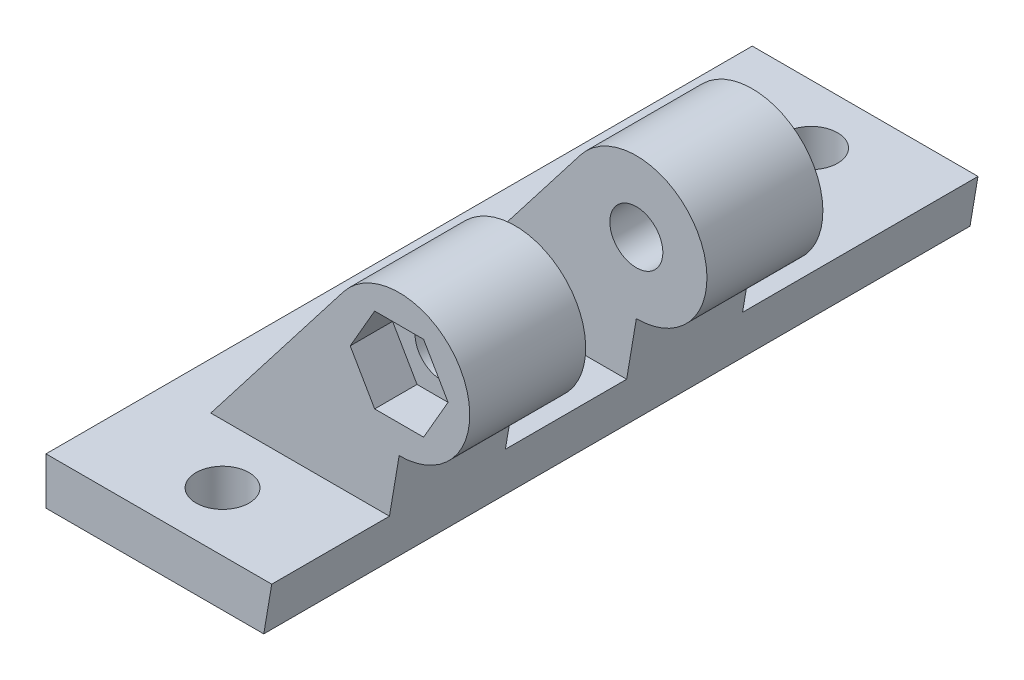
ISO-10303-21;
HEADER;
FILE_DESCRIPTION(('STEP AP214'),'2;1');
FILE_NAME('part.step','',(''),(''),'','','');
FILE_SCHEMA(('AUTOMOTIVE_DESIGN { 1 0 10303 214 1 1 1 1 }'));
ENDSEC;
DATA;
#1=APPLICATION_CONTEXT('core data for automotive mechanical design processes');
#2=APPLICATION_PROTOCOL_DEFINITION('international standard','automotive_design',2000,#1);
#3=PRODUCT_CONTEXT('',#1,'mechanical');
#4=PRODUCT('Part','Part','',(#3));
#5=PRODUCT_RELATED_PRODUCT_CATEGORY('part','',(#4));
#6=PRODUCT_DEFINITION_FORMATION('','',#4);
#7=PRODUCT_DEFINITION_CONTEXT('part definition',#1,'design');
#8=PRODUCT_DEFINITION('design','',#6,#7);
#9=PRODUCT_DEFINITION_SHAPE('','',#8);
#10=(LENGTH_UNIT() NAMED_UNIT(*) SI_UNIT(.MILLI.,.METRE.));
#11=(NAMED_UNIT(*) PLANE_ANGLE_UNIT() SI_UNIT($,.RADIAN.));
#12=(NAMED_UNIT(*) SI_UNIT($,.STERADIAN.) SOLID_ANGLE_UNIT());
#13=UNCERTAINTY_MEASURE_WITH_UNIT(LENGTH_MEASURE(1.E-05),#10,'distance_accuracy_value','');
#14=(GEOMETRIC_REPRESENTATION_CONTEXT(3) GLOBAL_UNCERTAINTY_ASSIGNED_CONTEXT((#13)) GLOBAL_UNIT_ASSIGNED_CONTEXT((#10,
#11,#12)) REPRESENTATION_CONTEXT('',''));
#15=CARTESIAN_POINT('',(0.,0.,0.));
#16=DIRECTION('',(0.,0.,1.));
#17=DIRECTION('',(1.,0.,0.));
#18=AXIS2_PLACEMENT_3D('',#15,#16,#17);
#19=CARTESIAN_POINT('',(10.,15.8653034599232,10.15));
#20=DIRECTION('',(0.,0.,1.));
#21=DIRECTION('',(1.,0.,0.));
#22=AXIS2_PLACEMENT_3D('',#19,#20,#21);
#23=CYLINDRICAL_SURFACE('',#22,2.25);
#24=CARTESIAN_POINT('',(10.,15.8653034599232,10.15));
#25=DIRECTION('',(0.,0.,1.));
#26=DIRECTION('',(1.,0.,0.));
#27=AXIS2_PLACEMENT_3D('',#24,#25,#26);
#28=CIRCLE('',#27,2.25);
#29=CARTESIAN_POINT('',(12.25,15.8653034599232,10.15));
#30=VERTEX_POINT('',#29);
#31=EDGE_CURVE('E317',#30,#30,#28,.T.);
#32=ORIENTED_EDGE('',*,*,#31,.F.);
#33=EDGE_LOOP('',(#32));
#34=FACE_BOUND('',#33,.T.);
#35=CARTESIAN_POINT('',(10.,15.8653034599232,16.4));
#36=DIRECTION('',(0.,0.,1.));
#37=DIRECTION('',(1.,0.,0.));
#38=AXIS2_PLACEMENT_3D('',#35,#36,#37);
#39=CIRCLE('',#38,2.25);
#40=CARTESIAN_POINT('',(12.25,15.8653034599232,16.4));
#41=VERTEX_POINT('',#40);
#42=EDGE_CURVE('E43',#41,#41,#39,.F.);
#43=ORIENTED_EDGE('',*,*,#42,.F.);
#44=EDGE_LOOP('',(#43));
#45=FACE_BOUND('',#44,.T.);
#46=ADVANCED_FACE('F39',(#34,#45),#23,.F.);
#47=CARTESIAN_POINT('',(-10.,5.,-30.));
#48=DIRECTION('',(0.,0.,1.));
#49=DIRECTION('',(1.,0.,0.));
#50=AXIS2_PLACEMENT_3D('',#47,#48,#49);
#51=PLANE('',#50);
#52=DIRECTION('',(-1.,0.,0.));
#53=VECTOR('',#52,1.);
#54=CARTESIAN_POINT('',(-10.,5.,-30.));
#55=LINE('',#54,#53);
#56=CARTESIAN_POINT('',(9.17679578337323,5.,-30.));
#57=VERTEX_POINT('',#56);
#58=CARTESIAN_POINT('',(-10.,5.,-30.));
#59=VERTEX_POINT('',#58);
#60=EDGE_CURVE('E369',#57,#59,#55,.T.);
#61=ORIENTED_EDGE('',*,*,#60,.F.);
#62=DIRECTION('',(0.166827799797444,0.985986047170417,0.));
#63=VECTOR('',#62,1.);
#64=CARTESIAN_POINT('',(8.5,1.,-30.));
#65=LINE('',#64,#63);
#66=CARTESIAN_POINT('',(8.5,1.,-30.));
#67=VERTEX_POINT('',#66);
#68=EDGE_CURVE('E243',#67,#57,#65,.T.);
#69=ORIENTED_EDGE('',*,*,#68,.F.);
#70=DIRECTION('',(1.,0.,0.));
#71=VECTOR('',#70,1.);
#72=CARTESIAN_POINT('',(-10.,1.,-30.));
#73=LINE('',#72,#71);
#74=CARTESIAN_POINT('',(-10.,1.,-30.));
#75=VERTEX_POINT('',#74);
#76=EDGE_CURVE('E279',#75,#67,#73,.T.);
#77=ORIENTED_EDGE('',*,*,#76,.F.);
#78=DIRECTION('',(0.,-1.,0.));
#79=VECTOR('',#78,1.);
#80=CARTESIAN_POINT('',(-10.,5.,-30.));
#81=LINE('',#80,#79);
#82=EDGE_CURVE('E11',#59,#75,#81,.T.);
#83=ORIENTED_EDGE('',*,*,#82,.F.);
#84=EDGE_LOOP('',(#61,#69,#77,#83));
#85=FACE_BOUND('',#84,.T.);
#86=ADVANCED_FACE('F41',(#85),#51,.F.);
#87=CARTESIAN_POINT('',(-10.,5.,30.));
#88=DIRECTION('',(1.,0.,0.));
#89=DIRECTION('',(0.,0.,-1.));
#90=AXIS2_PLACEMENT_3D('',#87,#88,#89);
#91=PLANE('',#90);
#92=DIRECTION('',(0.,0.,-1.));
#93=VECTOR('',#92,1.);
#94=CARTESIAN_POINT('',(-10.,1.,30.));
#95=LINE('',#94,#93);
#96=CARTESIAN_POINT('',(-10.,1.,30.));
#97=VERTEX_POINT('',#96);
#98=EDGE_CURVE('E276',#97,#75,#95,.T.);
#99=ORIENTED_EDGE('',*,*,#98,.F.);
#100=DIRECTION('',(0.,-1.,0.));
#101=VECTOR('',#100,1.);
#102=CARTESIAN_POINT('',(-10.,5.,30.));
#103=LINE('',#102,#101);
#104=CARTESIAN_POINT('',(-10.,5.,30.));
#105=VERTEX_POINT('',#104);
#106=EDGE_CURVE('E49',#105,#97,#103,.T.);
#107=ORIENTED_EDGE('',*,*,#106,.F.);
#108=DIRECTION('',(0.,0.,1.));
#109=VECTOR('',#108,1.);
#110=CARTESIAN_POINT('',(-10.,5.,30.));
#111=LINE('',#110,#109);
#112=EDGE_CURVE('E372',#59,#105,#111,.T.);
#113=ORIENTED_EDGE('',*,*,#112,.F.);
#114=ORIENTED_EDGE('',*,*,#82,.T.);
#115=EDGE_LOOP('',(#99,#107,#113,#114));
#116=FACE_BOUND('',#115,.T.);
#117=ADVANCED_FACE('F429',(#116),#91,.F.);
#118=CARTESIAN_POINT('',(-10.,5.,30.));
#119=DIRECTION('',(0.,0.,-1.));
#120=DIRECTION('',(-1.,0.,0.));
#121=AXIS2_PLACEMENT_3D('',#118,#119,#120);
#122=PLANE('',#121);
#123=DIRECTION('',(-1.,0.,0.));
#124=VECTOR('',#123,1.);
#125=CARTESIAN_POINT('',(-10.,1.,30.));
#126=LINE('',#125,#124);
#127=CARTESIAN_POINT('',(8.49999999999998,1.,30.));
#128=VERTEX_POINT('',#127);
#129=EDGE_CURVE('E272',#128,#97,#126,.T.);
#130=ORIENTED_EDGE('',*,*,#129,.F.);
#131=DIRECTION('',(0.166827799797444,0.985986047170417,0.));
#132=VECTOR('',#131,1.);
#133=CARTESIAN_POINT('',(8.49999999999998,1.,30.));
#134=LINE('',#133,#132);
#135=CARTESIAN_POINT('',(9.17679578337321,5.,30.));
#136=VERTEX_POINT('',#135);
#137=EDGE_CURVE('E65',#128,#136,#134,.T.);
#138=ORIENTED_EDGE('',*,*,#137,.T.);
#139=DIRECTION('',(1.,0.,0.));
#140=VECTOR('',#139,1.);
#141=CARTESIAN_POINT('',(-10.,5.,30.));
#142=LINE('',#141,#140);
#143=EDGE_CURVE('E375',#105,#136,#142,.T.);
#144=ORIENTED_EDGE('',*,*,#143,.F.);
#145=ORIENTED_EDGE('',*,*,#106,.T.);
#146=EDGE_LOOP('',(#130,#138,#144,#145));
#147=FACE_BOUND('',#146,.T.);
#148=ADVANCED_FACE('F452',(#147),#122,.F.);
#149=CARTESIAN_POINT('',(0.,5.,-25.));
#150=DIRECTION('',(0.,-1.,0.));
#151=DIRECTION('',(0.,0.,-1.));
#152=AXIS2_PLACEMENT_3D('',#149,#150,#151);
#153=CYLINDRICAL_SURFACE('',#152,2.25);
#154=CARTESIAN_POINT('',(0.,5.,-25.));
#155=DIRECTION('',(0.,1.,0.));
#156=DIRECTION('',(0.,0.,1.));
#157=AXIS2_PLACEMENT_3D('',#154,#155,#156);
#158=CIRCLE('',#157,2.25);
#159=CARTESIAN_POINT('',(0.,5.,-22.75));
#160=VERTEX_POINT('',#159);
#161=EDGE_CURVE('E365',#160,#160,#158,.T.);
#162=ORIENTED_EDGE('',*,*,#161,.T.);
#163=EDGE_LOOP('',(#162));
#164=FACE_BOUND('',#163,.T.);
#165=CARTESIAN_POINT('',(0.,1.,-25.));
#166=DIRECTION('',(0.,-1.,0.));
#167=DIRECTION('',(0.,0.,-1.));
#168=AXIS2_PLACEMENT_3D('',#165,#166,#167);
#169=CIRCLE('',#168,2.25);
#170=CARTESIAN_POINT('',(0.,1.,-27.25));
#171=VERTEX_POINT('',#170);
#172=EDGE_CURVE('E268',#171,#171,#169,.T.);
#173=ORIENTED_EDGE('',*,*,#172,.T.);
#174=EDGE_LOOP('',(#173));
#175=FACE_BOUND('',#174,.T.);
#176=ADVANCED_FACE('F448',(#164,#175),#153,.F.);
#177=CARTESIAN_POINT('',(0.,5.,25.));
#178=DIRECTION('',(0.,-1.,0.));
#179=DIRECTION('',(0.,0.,-1.));
#180=AXIS2_PLACEMENT_3D('',#177,#178,#179);
#181=CYLINDRICAL_SURFACE('',#180,2.25);
#182=CARTESIAN_POINT('',(0.,5.,25.));
#183=DIRECTION('',(0.,1.,0.));
#184=DIRECTION('',(0.,0.,1.));
#185=AXIS2_PLACEMENT_3D('',#182,#183,#184);
#186=CIRCLE('',#185,2.25);
#187=CARTESIAN_POINT('',(0.,5.,27.25));
#188=VERTEX_POINT('',#187);
#189=EDGE_CURVE('E356',#188,#188,#186,.T.);
#190=ORIENTED_EDGE('',*,*,#189,.T.);
#191=EDGE_LOOP('',(#190));
#192=FACE_BOUND('',#191,.T.);
#193=CARTESIAN_POINT('',(0.,1.,25.));
#194=DIRECTION('',(0.,-1.,0.));
#195=DIRECTION('',(0.,0.,-1.));
#196=AXIS2_PLACEMENT_3D('',#193,#194,#195);
#197=CIRCLE('',#196,2.25);
#198=CARTESIAN_POINT('',(0.,1.,22.75));
#199=VERTEX_POINT('',#198);
#200=EDGE_CURVE('E273',#199,#199,#197,.T.);
#201=ORIENTED_EDGE('',*,*,#200,.T.);
#202=EDGE_LOOP('',(#201));
#203=FACE_BOUND('',#202,.T.);
#204=ADVANCED_FACE('F445',(#192,#203),#181,.F.);
#205=CARTESIAN_POINT('',(0.,5.,0.));
#206=DIRECTION('',(0.,-1.,0.));
#207=DIRECTION('',(0.,0.,-1.));
#208=AXIS2_PLACEMENT_3D('',#205,#206,#207);
#209=PLANE('',#208);
#210=ORIENTED_EDGE('',*,*,#161,.F.);
#211=EDGE_LOOP('',(#210));
#212=FACE_BOUND('',#211,.T.);
#213=ORIENTED_EDGE('',*,*,#189,.F.);
#214=EDGE_LOOP('',(#213));
#215=FACE_BOUND('',#214,.T.);
#216=ORIENTED_EDGE('',*,*,#143,.T.);
#217=DIRECTION('',(0.,0.,-1.));
#218=VECTOR('',#217,1.);
#219=CARTESIAN_POINT('',(9.17679578337322,5.,0.));
#220=LINE('',#219,#218);
#221=CARTESIAN_POINT('',(9.17679578337321,5.,20.));
#222=VERTEX_POINT('',#221);
#223=EDGE_CURVE('E256',#136,#222,#220,.T.);
#224=ORIENTED_EDGE('',*,*,#223,.T.);
#225=DIRECTION('',(1.,0.,0.));
#226=VECTOR('',#225,1.);
#227=CARTESIAN_POINT('',(10.,5.,20.));
#228=LINE('',#227,#226);
#229=CARTESIAN_POINT('',(-5.99999999999998,5.,20.));
#230=VERTEX_POINT('',#229);
#231=EDGE_CURVE('E334',#230,#222,#228,.T.);
#232=ORIENTED_EDGE('',*,*,#231,.F.);
#233=DIRECTION('',(0.,0.,1.));
#234=VECTOR('',#233,1.);
#235=CARTESIAN_POINT('',(-5.99999999999998,5.,10.15));
#236=LINE('',#235,#234);
#237=CARTESIAN_POINT('',(-5.99999999999998,5.,10.15));
#238=VERTEX_POINT('',#237);
#239=EDGE_CURVE('E357',#238,#230,#236,.T.);
#240=ORIENTED_EDGE('',*,*,#239,.F.);
#241=DIRECTION('',(1.,0.,0.));
#242=VECTOR('',#241,1.);
#243=CARTESIAN_POINT('',(10.,5.,10.15));
#244=LINE('',#243,#242);
#245=CARTESIAN_POINT('',(9.17679578337322,5.,10.15));
#246=VERTEX_POINT('',#245);
#247=EDGE_CURVE('E338',#238,#246,#244,.T.);
#248=ORIENTED_EDGE('',*,*,#247,.T.);
#249=CARTESIAN_POINT('',(9.17679578337322,5.,-0.149999999999996));
#250=VERTEX_POINT('',#249);
#251=EDGE_CURVE('E257',#246,#250,#220,.T.);
#252=ORIENTED_EDGE('',*,*,#251,.T.);
#253=DIRECTION('',(-1.,0.,0.));
#254=VECTOR('',#253,1.);
#255=CARTESIAN_POINT('',(10.,5.,-0.149999999999996));
#256=LINE('',#255,#254);
#257=CARTESIAN_POINT('',(-5.99999999999998,5.,-0.149999999999996));
#258=VERTEX_POINT('',#257);
#259=EDGE_CURVE('E296',#250,#258,#256,.T.);
#260=ORIENTED_EDGE('',*,*,#259,.T.);
#261=DIRECTION('',(0.,0.,-1.));
#262=VECTOR('',#261,1.);
#263=CARTESIAN_POINT('',(-5.99999999999998,5.,-0.149999999999996));
#264=LINE('',#263,#262);
#265=CARTESIAN_POINT('',(-5.99999999999998,5.,-9.99999999999999));
#266=VERTEX_POINT('',#265);
#267=EDGE_CURVE('E318',#258,#266,#264,.T.);
#268=ORIENTED_EDGE('',*,*,#267,.T.);
#269=DIRECTION('',(-1.,0.,0.));
#270=VECTOR('',#269,1.);
#271=CARTESIAN_POINT('',(10.,5.,-9.99999999999999));
#272=LINE('',#271,#270);
#273=CARTESIAN_POINT('',(9.17679578337322,5.,-9.99999999999999));
#274=VERTEX_POINT('',#273);
#275=EDGE_CURVE('E308',#274,#266,#272,.T.);
#276=ORIENTED_EDGE('',*,*,#275,.F.);
#277=EDGE_CURVE('E251',#274,#57,#220,.T.);
#278=ORIENTED_EDGE('',*,*,#277,.T.);
#279=ORIENTED_EDGE('',*,*,#60,.T.);
#280=ORIENTED_EDGE('',*,*,#112,.T.);
#281=EDGE_LOOP('',(#216,#224,#232,#240,#248,#252,#260,#268,#276,#278,#279,#280));
#282=FACE_BOUND('',#281,.T.);
#283=ADVANCED_FACE('F392',(#212,#215,#282),#209,.F.);
#284=CARTESIAN_POINT('',(10.,15.8653034599232,10.15));
#285=DIRECTION('',(0.,0.,1.));
#286=DIRECTION('',(1.,0.,0.));
#287=AXIS2_PLACEMENT_3D('',#284,#285,#286);
#288=CYLINDRICAL_SURFACE('',#287,6.);
#289=CARTESIAN_POINT('',(10.,15.8653034599232,20.));
#290=DIRECTION('',(0.,0.,1.));
#291=DIRECTION('',(1.,0.,0.));
#292=AXIS2_PLACEMENT_3D('',#289,#290,#291);
#293=CIRCLE('',#292,6.);
#294=CARTESIAN_POINT('',(10.,9.86530345992323,20.));
#295=VERTEX_POINT('',#294);
#296=CARTESIAN_POINT('',(5.25568408624558,19.5383766296949,20.));
#297=VERTEX_POINT('',#296);
#298=EDGE_CURVE('E328',#295,#297,#293,.T.);
#299=ORIENTED_EDGE('',*,*,#298,.F.);
#300=DIRECTION('',(0.,0.,1.));
#301=VECTOR('',#300,1.);
#302=CARTESIAN_POINT('',(10.,9.86530345992323,10.15));
#303=LINE('',#302,#301);
#304=CARTESIAN_POINT('',(10.,9.86530345992323,10.15));
#305=VERTEX_POINT('',#304);
#306=EDGE_CURVE('E353',#305,#295,#303,.T.);
#307=ORIENTED_EDGE('',*,*,#306,.F.);
#308=CARTESIAN_POINT('',(10.,15.8653034599232,10.15));
#309=DIRECTION('',(0.,0.,1.));
#310=DIRECTION('',(1.,0.,0.));
#311=AXIS2_PLACEMENT_3D('',#308,#309,#310);
#312=CIRCLE('',#311,6.);
#313=CARTESIAN_POINT('',(5.25568408624558,19.5383766296949,10.15));
#314=VERTEX_POINT('',#313);
#315=EDGE_CURVE('E329',#305,#314,#312,.T.);
#316=ORIENTED_EDGE('',*,*,#315,.T.);
#317=DIRECTION('',(0.,0.,1.));
#318=VECTOR('',#317,1.);
#319=CARTESIAN_POINT('',(5.25568408624558,19.5383766296949,10.15));
#320=LINE('',#319,#318);
#321=EDGE_CURVE('E342',#314,#297,#320,.T.);
#322=ORIENTED_EDGE('',*,*,#321,.T.);
#323=EDGE_LOOP('',(#299,#307,#316,#322));
#324=FACE_BOUND('',#323,.T.);
#325=ADVANCED_FACE('F440',(#324),#288,.T.);
#326=CARTESIAN_POINT('',(-5.99999999999998,5.,10.15));
#327=DIRECTION('',(-0.790719318959074,0.612178861628608,0.));
#328=DIRECTION('',(-0.612178861628608,-0.790719318959074,0.));
#329=AXIS2_PLACEMENT_3D('',#326,#327,#328);
#330=PLANE('',#329);
#331=DIRECTION('',(-0.612178861628608,-0.790719318959074,0.));
#332=VECTOR('',#331,1.);
#333=CARTESIAN_POINT('',(-5.99999999999998,5.,20.));
#334=LINE('',#333,#332);
#335=EDGE_CURVE('E346',#297,#230,#334,.T.);
#336=ORIENTED_EDGE('',*,*,#335,.F.);
#337=ORIENTED_EDGE('',*,*,#321,.F.);
#338=DIRECTION('',(-0.612178861628608,-0.790719318959074,0.));
#339=VECTOR('',#338,1.);
#340=CARTESIAN_POINT('',(-5.99999999999998,5.,10.15));
#341=LINE('',#340,#339);
#342=EDGE_CURVE('E333',#314,#238,#341,.T.);
#343=ORIENTED_EDGE('',*,*,#342,.T.);
#344=ORIENTED_EDGE('',*,*,#239,.T.);
#345=EDGE_LOOP('',(#336,#337,#343,#344));
#346=FACE_BOUND('',#345,.T.);
#347=ADVANCED_FACE('F435',(#346),#330,.T.);
#348=CARTESIAN_POINT('',(10.,15.8653034599232,10.15));
#349=DIRECTION('',(0.,0.,1.));
#350=DIRECTION('',(1.,0.,0.));
#351=AXIS2_PLACEMENT_3D('',#348,#349,#350);
#352=PLANE('',#351);
#353=ORIENTED_EDGE('',*,*,#31,.T.);
#354=EDGE_LOOP('',(#353));
#355=FACE_BOUND('',#354,.T.);
#356=ORIENTED_EDGE('',*,*,#315,.F.);
#357=DIRECTION('',(-0.166827799797444,-0.985986047170417,0.));
#358=VECTOR('',#357,1.);
#359=CARTESIAN_POINT('',(10.9869392972825,15.6983143712117,10.15));
#360=LINE('',#359,#358);
#361=EDGE_CURVE('E261',#305,#246,#360,.T.);
#362=ORIENTED_EDGE('',*,*,#361,.T.);
#363=ORIENTED_EDGE('',*,*,#247,.F.);
#364=ORIENTED_EDGE('',*,*,#342,.F.);
#365=EDGE_LOOP('',(#356,#362,#363,#364));
#366=FACE_BOUND('',#365,.T.);
#367=ADVANCED_FACE('F420',(#355,#366),#352,.F.);
#368=CARTESIAN_POINT('',(10.,15.8653034599232,20.));
#369=DIRECTION('',(0.,0.,1.));
#370=DIRECTION('',(1.,0.,0.));
#371=AXIS2_PLACEMENT_3D('',#368,#369,#370);
#372=PLANE('',#371);
#373=DIRECTION('',(1.,0.,0.));
#374=VECTOR('',#373,1.);
#375=CARTESIAN_POINT('',(7.92153903091737,12.2653034599232,20.));
#376=LINE('',#375,#374);
#377=CARTESIAN_POINT('',(7.92153903091737,12.2653034599232,20.));
#378=VERTEX_POINT('',#377);
#379=CARTESIAN_POINT('',(12.0784609690827,12.2653034599232,20.));
#380=VERTEX_POINT('',#379);
#381=EDGE_CURVE('E57',#378,#380,#376,.T.);
#382=ORIENTED_EDGE('',*,*,#381,.F.);
#383=DIRECTION('',(0.5,-0.866025403784439,0.));
#384=VECTOR('',#383,1.);
#385=CARTESIAN_POINT('',(5.84307806183472,15.8653034599232,20.));
#386=LINE('',#385,#384);
#387=CARTESIAN_POINT('',(5.84307806183472,15.8653034599232,20.));
#388=VERTEX_POINT('',#387);
#389=EDGE_CURVE('E192',#388,#378,#386,.T.);
#390=ORIENTED_EDGE('',*,*,#389,.F.);
#391=DIRECTION('',(-0.5,-0.866025403784439,0.));
#392=VECTOR('',#391,1.);
#393=CARTESIAN_POINT('',(7.92153903091737,19.4653034599232,20.));
#394=LINE('',#393,#392);
#395=CARTESIAN_POINT('',(7.92153903091737,19.4653034599232,20.));
#396=VERTEX_POINT('',#395);
#397=EDGE_CURVE('E196',#396,#388,#394,.T.);
#398=ORIENTED_EDGE('',*,*,#397,.F.);
#399=DIRECTION('',(-1.,0.,0.));
#400=VECTOR('',#399,1.);
#401=CARTESIAN_POINT('',(12.0784609690827,19.4653034599232,20.));
#402=LINE('',#401,#400);
#403=CARTESIAN_POINT('',(12.0784609690827,19.4653034599232,20.));
#404=VERTEX_POINT('',#403);
#405=EDGE_CURVE('E219',#404,#396,#402,.T.);
#406=ORIENTED_EDGE('',*,*,#405,.F.);
#407=DIRECTION('',(-0.5,0.866025403784439,0.));
#408=VECTOR('',#407,1.);
#409=CARTESIAN_POINT('',(14.1569219381653,15.8653034599232,20.));
#410=LINE('',#409,#408);
#411=CARTESIAN_POINT('',(14.1569219381653,15.8653034599232,20.));
#412=VERTEX_POINT('',#411);
#413=EDGE_CURVE('E215',#412,#404,#410,.T.);
#414=ORIENTED_EDGE('',*,*,#413,.F.);
#415=DIRECTION('',(0.5,0.866025403784439,0.));
#416=VECTOR('',#415,1.);
#417=CARTESIAN_POINT('',(12.0784609690827,12.2653034599232,20.));
#418=LINE('',#417,#416);
#419=EDGE_CURVE('E212',#380,#412,#418,.T.);
#420=ORIENTED_EDGE('',*,*,#419,.F.);
#421=EDGE_LOOP('',(#382,#390,#398,#406,#414,#420));
#422=FACE_BOUND('',#421,.T.);
#423=DIRECTION('',(-0.166827799797444,-0.985986047170417,0.));
#424=VECTOR('',#423,1.);
#425=CARTESIAN_POINT('',(10.9869392972825,15.6983143712117,20.));
#426=LINE('',#425,#424);
#427=EDGE_CURVE('E265',#295,#222,#426,.T.);
#428=ORIENTED_EDGE('',*,*,#427,.F.);
#429=ORIENTED_EDGE('',*,*,#298,.T.);
#430=ORIENTED_EDGE('',*,*,#335,.T.);
#431=ORIENTED_EDGE('',*,*,#231,.T.);
#432=EDGE_LOOP('',(#428,#429,#430,#431));
#433=FACE_BOUND('',#432,.T.);
#434=ADVANCED_FACE('F413',(#422,#433),#372,.T.);
#435=CARTESIAN_POINT('',(10.,15.8653034599232,-0.149999999999996));
#436=DIRECTION('',(0.,0.,-1.));
#437=DIRECTION('',(-1.,0.,0.));
#438=AXIS2_PLACEMENT_3D('',#435,#436,#437);
#439=CYLINDRICAL_SURFACE('',#438,6.00000000000001);
#440=CARTESIAN_POINT('',(10.,15.8653034599232,-9.99999999999999));
#441=DIRECTION('',(0.,0.,-1.));
#442=DIRECTION('',(-1.,0.,0.));
#443=AXIS2_PLACEMENT_3D('',#440,#441,#442);
#444=CIRCLE('',#443,6.00000000000001);
#445=CARTESIAN_POINT('',(5.29341514188912,19.5866014825762,-9.99999999999999));
#446=VERTEX_POINT('',#445);
#447=CARTESIAN_POINT('',(10.,9.86530345992323,-9.99999999999998));
#448=VERTEX_POINT('',#447);
#449=EDGE_CURVE('E288',#446,#448,#444,.T.);
#450=ORIENTED_EDGE('',*,*,#449,.F.);
#451=DIRECTION('',(0.,0.,-1.));
#452=VECTOR('',#451,1.);
#453=CARTESIAN_POINT('',(5.29341514188912,19.5866014825762,-0.149999999999996));
#454=LINE('',#453,#452);
#455=CARTESIAN_POINT('',(5.29341514188912,19.5866014825762,-0.149999999999996));
#456=VERTEX_POINT('',#455);
#457=EDGE_CURVE('E314',#456,#446,#454,.T.);
#458=ORIENTED_EDGE('',*,*,#457,.F.);
#459=CARTESIAN_POINT('',(10.,15.8653034599232,-0.149999999999996));
#460=DIRECTION('',(0.,0.,-1.));
#461=DIRECTION('',(-1.,0.,0.));
#462=AXIS2_PLACEMENT_3D('',#459,#460,#461);
#463=CIRCLE('',#462,6.00000000000001);
#464=CARTESIAN_POINT('',(10.,9.86530345992323,-0.14999999999999));
#465=VERTEX_POINT('',#464);
#466=EDGE_CURVE('E292',#456,#465,#463,.T.);
#467=ORIENTED_EDGE('',*,*,#466,.T.);
#468=DIRECTION('',(0.,0.,-1.));
#469=VECTOR('',#468,1.);
#470=CARTESIAN_POINT('',(10.,9.86530345992323,-0.149999999999996));
#471=LINE('',#470,#469);
#472=EDGE_CURVE('E304',#465,#448,#471,.T.);
#473=ORIENTED_EDGE('',*,*,#472,.T.);
#474=EDGE_LOOP('',(#450,#458,#467,#473));
#475=FACE_BOUND('',#474,.T.);
#476=ADVANCED_FACE('F411',(#475),#439,.T.);
#477=CARTESIAN_POINT('',(-5.99999999999998,5.,-0.149999999999996));
#478=DIRECTION('',(-0.790708950577508,0.612192253688836,0.));
#479=DIRECTION('',(-0.612192253688836,-0.790708950577508,0.));
#480=AXIS2_PLACEMENT_3D('',#477,#478,#479);
#481=PLANE('',#480);
#482=DIRECTION('',(0.612192253688836,0.790708950577508,0.));
#483=VECTOR('',#482,1.);
#484=CARTESIAN_POINT('',(-5.99999999999998,5.,-9.99999999999999));
#485=LINE('',#484,#483);
#486=EDGE_CURVE('E297',#266,#446,#485,.T.);
#487=ORIENTED_EDGE('',*,*,#486,.F.);
#488=ORIENTED_EDGE('',*,*,#267,.F.);
#489=DIRECTION('',(0.612192253688836,0.790708950577508,0.));
#490=VECTOR('',#489,1.);
#491=CARTESIAN_POINT('',(-5.99999999999998,5.,-0.149999999999996));
#492=LINE('',#491,#490);
#493=EDGE_CURVE('E300',#258,#456,#492,.T.);
#494=ORIENTED_EDGE('',*,*,#493,.T.);
#495=ORIENTED_EDGE('',*,*,#457,.T.);
#496=EDGE_LOOP('',(#487,#488,#494,#495));
#497=FACE_BOUND('',#496,.T.);
#498=ADVANCED_FACE('F401',(#497),#481,.T.);
#499=CARTESIAN_POINT('',(10.,15.8653034599232,-0.149999999999996));
#500=DIRECTION('',(0.,0.,-1.));
#501=DIRECTION('',(-1.,0.,0.));
#502=AXIS2_PLACEMENT_3D('',#499,#500,#501);
#503=PLANE('',#502);
#504=CARTESIAN_POINT('',(10.,15.8653034599232,-0.149999999999996));
#505=DIRECTION('',(0.,0.,-1.));
#506=DIRECTION('',(-1.,0.,0.));
#507=AXIS2_PLACEMENT_3D('',#504,#505,#506);
#508=CIRCLE('',#507,2.25);
#509=CARTESIAN_POINT('',(7.75000000000002,15.8653034599232,-0.149999999999996));
#510=VERTEX_POINT('',#509);
#511=EDGE_CURVE('E284',#510,#510,#508,.T.);
#512=ORIENTED_EDGE('',*,*,#511,.T.);
#513=EDGE_LOOP('',(#512));
#514=FACE_BOUND('',#513,.T.);
#515=ORIENTED_EDGE('',*,*,#259,.F.);
#516=DIRECTION('',(0.166827799797444,0.985986047170417,0.));
#517=VECTOR('',#516,1.);
#518=CARTESIAN_POINT('',(10.9869392972825,15.6983143712117,-0.149999999999996));
#519=LINE('',#518,#517);
#520=EDGE_CURVE('E255',#250,#465,#519,.T.);
#521=ORIENTED_EDGE('',*,*,#520,.T.);
#522=ORIENTED_EDGE('',*,*,#466,.F.);
#523=ORIENTED_EDGE('',*,*,#493,.F.);
#524=EDGE_LOOP('',(#515,#521,#522,#523));
#525=FACE_BOUND('',#524,.T.);
#526=ADVANCED_FACE('F397',(#514,#525),#503,.F.);
#527=CARTESIAN_POINT('',(10.,15.8653034599232,-9.99999999999999));
#528=DIRECTION('',(0.,0.,-1.));
#529=DIRECTION('',(-1.,0.,0.));
#530=AXIS2_PLACEMENT_3D('',#527,#528,#529);
#531=PLANE('',#530);
#532=DIRECTION('',(0.166827799797444,0.985986047170417,0.));
#533=VECTOR('',#532,1.);
#534=CARTESIAN_POINT('',(10.9869392972825,15.6983143712117,-9.99999999999999));
#535=LINE('',#534,#533);
#536=EDGE_CURVE('E248',#274,#448,#535,.T.);
#537=ORIENTED_EDGE('',*,*,#536,.F.);
#538=ORIENTED_EDGE('',*,*,#275,.T.);
#539=ORIENTED_EDGE('',*,*,#486,.T.);
#540=ORIENTED_EDGE('',*,*,#449,.T.);
#541=EDGE_LOOP('',(#537,#538,#539,#540));
#542=FACE_BOUND('',#541,.T.);
#543=CARTESIAN_POINT('',(10.,15.8653034599232,-9.99999999999999));
#544=DIRECTION('',(0.,0.,-1.));
#545=DIRECTION('',(-1.,0.,0.));
#546=AXIS2_PLACEMENT_3D('',#543,#544,#545);
#547=CIRCLE('',#546,2.25);
#548=CARTESIAN_POINT('',(7.75000000000002,15.8653034599232,-9.99999999999999));
#549=VERTEX_POINT('',#548);
#550=EDGE_CURVE('E283',#549,#549,#547,.T.);
#551=ORIENTED_EDGE('',*,*,#550,.F.);
#552=EDGE_LOOP('',(#551));
#553=FACE_BOUND('',#552,.T.);
#554=ADVANCED_FACE('F407',(#542,#553),#531,.T.);
#555=CARTESIAN_POINT('',(10.,15.8653034599232,-0.149999999999996));
#556=DIRECTION('',(0.,0.,-1.));
#557=DIRECTION('',(-1.,0.,0.));
#558=AXIS2_PLACEMENT_3D('',#555,#556,#557);
#559=CYLINDRICAL_SURFACE('',#558,2.25);
#560=ORIENTED_EDGE('',*,*,#511,.F.);
#561=EDGE_LOOP('',(#560));
#562=FACE_BOUND('',#561,.T.);
#563=ORIENTED_EDGE('',*,*,#550,.T.);
#564=EDGE_LOOP('',(#563));
#565=FACE_BOUND('',#564,.T.);
#566=ADVANCED_FACE('F475',(#562,#565),#559,.F.);
#567=CARTESIAN_POINT('',(0.,1.,0.));
#568=DIRECTION('',(0.,-1.,0.));
#569=DIRECTION('',(0.,0.,-1.));
#570=AXIS2_PLACEMENT_3D('',#567,#568,#569);
#571=PLANE('',#570);
#572=DIRECTION('',(0.,0.,-1.));
#573=VECTOR('',#572,1.);
#574=CARTESIAN_POINT('',(8.49999999999998,1.,30.));
#575=LINE('',#574,#573);
#576=EDGE_CURVE('E242',#128,#67,#575,.T.);
#577=ORIENTED_EDGE('',*,*,#576,.F.);
#578=ORIENTED_EDGE('',*,*,#129,.T.);
#579=ORIENTED_EDGE('',*,*,#98,.T.);
#580=ORIENTED_EDGE('',*,*,#76,.T.);
#581=EDGE_LOOP('',(#577,#578,#579,#580));
#582=FACE_BOUND('',#581,.T.);
#583=ORIENTED_EDGE('',*,*,#200,.F.);
#584=EDGE_LOOP('',(#583));
#585=FACE_BOUND('',#584,.T.);
#586=ORIENTED_EDGE('',*,*,#172,.F.);
#587=EDGE_LOOP('',(#586));
#588=FACE_BOUND('',#587,.T.);
#589=ADVANCED_FACE('F472',(#582,#585,#588),#571,.T.);
#590=CARTESIAN_POINT('',(8.49999999999998,1.,30.));
#591=DIRECTION('',(-0.985986047170417,0.166827799797444,0.));
#592=DIRECTION('',(-0.166827799797444,-0.985986047170417,0.));
#593=AXIS2_PLACEMENT_3D('',#590,#591,#592);
#594=PLANE('',#593);
#595=ORIENTED_EDGE('',*,*,#137,.F.);
#596=ORIENTED_EDGE('',*,*,#576,.T.);
#597=ORIENTED_EDGE('',*,*,#68,.T.);
#598=ORIENTED_EDGE('',*,*,#277,.F.);
#599=ORIENTED_EDGE('',*,*,#536,.T.);
#600=ORIENTED_EDGE('',*,*,#472,.F.);
#601=ORIENTED_EDGE('',*,*,#520,.F.);
#602=ORIENTED_EDGE('',*,*,#251,.F.);
#603=ORIENTED_EDGE('',*,*,#361,.F.);
#604=ORIENTED_EDGE('',*,*,#306,.T.);
#605=ORIENTED_EDGE('',*,*,#427,.T.);
#606=ORIENTED_EDGE('',*,*,#223,.F.);
#607=EDGE_LOOP('',(#595,#596,#597,#598,#599,#600,#601,#602,#603,#604,#605,#606));
#608=FACE_BOUND('',#607,.T.);
#609=ADVANCED_FACE('F409',(#608),#594,.F.);
#610=CARTESIAN_POINT('',(0.,0.,16.4));
#611=DIRECTION('',(0.,0.,1.));
#612=DIRECTION('',(1.,0.,0.));
#613=AXIS2_PLACEMENT_3D('',#610,#611,#612);
#614=PLANE('',#613);
#615=DIRECTION('',(1.,0.,0.));
#616=VECTOR('',#615,1.);
#617=CARTESIAN_POINT('',(7.92153903091737,12.2653034599232,16.4));
#618=LINE('',#617,#616);
#619=CARTESIAN_POINT('',(7.92153903091737,12.2653034599232,16.4));
#620=VERTEX_POINT('',#619);
#621=CARTESIAN_POINT('',(12.0784609690827,12.2653034599232,16.4));
#622=VERTEX_POINT('',#621);
#623=EDGE_CURVE('E169',#620,#622,#618,.T.);
#624=ORIENTED_EDGE('',*,*,#623,.T.);
#625=DIRECTION('',(0.5,0.866025403784439,0.));
#626=VECTOR('',#625,1.);
#627=CARTESIAN_POINT('',(12.0784609690827,12.2653034599232,16.4));
#628=LINE('',#627,#626);
#629=CARTESIAN_POINT('',(14.1569219381653,15.8653034599232,16.4));
#630=VERTEX_POINT('',#629);
#631=EDGE_CURVE('E179',#622,#630,#628,.T.);
#632=ORIENTED_EDGE('',*,*,#631,.T.);
#633=DIRECTION('',(-0.5,0.866025403784439,0.));
#634=VECTOR('',#633,1.);
#635=CARTESIAN_POINT('',(14.1569219381653,15.8653034599232,16.4));
#636=LINE('',#635,#634);
#637=CARTESIAN_POINT('',(12.0784609690827,19.4653034599232,16.4));
#638=VERTEX_POINT('',#637);
#639=EDGE_CURVE('E185',#630,#638,#636,.T.);
#640=ORIENTED_EDGE('',*,*,#639,.T.);
#641=DIRECTION('',(-1.,0.,0.));
#642=VECTOR('',#641,1.);
#643=CARTESIAN_POINT('',(12.0784609690827,19.4653034599232,16.4));
#644=LINE('',#643,#642);
#645=CARTESIAN_POINT('',(7.92153903091737,19.4653034599232,16.4));
#646=VERTEX_POINT('',#645);
#647=EDGE_CURVE('E201',#638,#646,#644,.T.);
#648=ORIENTED_EDGE('',*,*,#647,.T.);
#649=DIRECTION('',(-0.5,-0.866025403784439,0.));
#650=VECTOR('',#649,1.);
#651=CARTESIAN_POINT('',(7.92153903091737,19.4653034599232,16.4));
#652=LINE('',#651,#650);
#653=CARTESIAN_POINT('',(5.84307806183472,15.8653034599232,16.4));
#654=VERTEX_POINT('',#653);
#655=EDGE_CURVE('E205',#646,#654,#652,.T.);
#656=ORIENTED_EDGE('',*,*,#655,.T.);
#657=DIRECTION('',(0.5,-0.866025403784439,0.));
#658=VECTOR('',#657,1.);
#659=CARTESIAN_POINT('',(5.84307806183472,15.8653034599232,16.4));
#660=LINE('',#659,#658);
#661=EDGE_CURVE('E176',#654,#620,#660,.T.);
#662=ORIENTED_EDGE('',*,*,#661,.T.);
#663=EDGE_LOOP('',(#624,#632,#640,#648,#656,#662));
#664=FACE_BOUND('',#663,.T.);
#665=ORIENTED_EDGE('',*,*,#42,.T.);
#666=EDGE_LOOP('',(#665));
#667=FACE_BOUND('',#666,.T.);
#668=ADVANCED_FACE('F187',(#664,#667),#614,.T.);
#669=CARTESIAN_POINT('',(7.92153903091737,12.2653034599232,16.4));
#670=DIRECTION('',(0.,-1.,0.));
#671=DIRECTION('',(0.,0.,-1.));
#672=AXIS2_PLACEMENT_3D('',#669,#670,#671);
#673=PLANE('',#672);
#674=ORIENTED_EDGE('',*,*,#381,.T.);
#675=DIRECTION('',(0.,0.,1.));
#676=VECTOR('',#675,1.);
#677=CARTESIAN_POINT('',(12.0784609690827,12.2653034599232,16.4));
#678=LINE('',#677,#676);
#679=EDGE_CURVE('E165',#622,#380,#678,.T.);
#680=ORIENTED_EDGE('',*,*,#679,.F.);
#681=ORIENTED_EDGE('',*,*,#623,.F.);
#682=DIRECTION('',(0.,0.,1.));
#683=VECTOR('',#682,1.);
#684=CARTESIAN_POINT('',(7.92153903091737,12.2653034599232,16.4));
#685=LINE('',#684,#683);
#686=EDGE_CURVE('E226',#620,#378,#685,.T.);
#687=ORIENTED_EDGE('',*,*,#686,.T.);
#688=EDGE_LOOP('',(#674,#680,#681,#687));
#689=FACE_BOUND('',#688,.T.);
#690=ADVANCED_FACE('F167',(#689),#673,.F.);
#691=CARTESIAN_POINT('',(5.84307806183472,15.8653034599232,16.4));
#692=DIRECTION('',(-0.866025403784439,-0.5,0.));
#693=DIRECTION('',(0.5,-0.866025403784439,0.));
#694=AXIS2_PLACEMENT_3D('',#691,#692,#693);
#695=PLANE('',#694);
#696=ORIENTED_EDGE('',*,*,#389,.T.);
#697=ORIENTED_EDGE('',*,*,#686,.F.);
#698=ORIENTED_EDGE('',*,*,#661,.F.);
#699=DIRECTION('',(0.,0.,1.));
#700=VECTOR('',#699,1.);
#701=CARTESIAN_POINT('',(5.84307806183472,15.8653034599232,16.4));
#702=LINE('',#701,#700);
#703=EDGE_CURVE('E229',#654,#388,#702,.T.);
#704=ORIENTED_EDGE('',*,*,#703,.T.);
#705=EDGE_LOOP('',(#696,#697,#698,#704));
#706=FACE_BOUND('',#705,.T.);
#707=ADVANCED_FACE('F592',(#706),#695,.F.);
#708=CARTESIAN_POINT('',(7.92153903091737,19.4653034599232,16.4));
#709=DIRECTION('',(-0.866025403784438,0.5,0.));
#710=DIRECTION('',(-0.5,-0.866025403784439,0.));
#711=AXIS2_PLACEMENT_3D('',#708,#709,#710);
#712=PLANE('',#711);
#713=ORIENTED_EDGE('',*,*,#397,.T.);
#714=ORIENTED_EDGE('',*,*,#703,.F.);
#715=ORIENTED_EDGE('',*,*,#655,.F.);
#716=DIRECTION('',(0.,0.,1.));
#717=VECTOR('',#716,1.);
#718=CARTESIAN_POINT('',(7.92153903091737,19.4653034599232,16.4));
#719=LINE('',#718,#717);
#720=EDGE_CURVE('E232',#646,#396,#719,.T.);
#721=ORIENTED_EDGE('',*,*,#720,.T.);
#722=EDGE_LOOP('',(#713,#714,#715,#721));
#723=FACE_BOUND('',#722,.T.);
#724=ADVANCED_FACE('F600',(#723),#712,.F.);
#725=CARTESIAN_POINT('',(12.0784609690827,19.4653034599232,16.4));
#726=DIRECTION('',(0.,1.,0.));
#727=DIRECTION('',(0.,0.,1.));
#728=AXIS2_PLACEMENT_3D('',#725,#726,#727);
#729=PLANE('',#728);
#730=ORIENTED_EDGE('',*,*,#405,.T.);
#731=ORIENTED_EDGE('',*,*,#720,.F.);
#732=ORIENTED_EDGE('',*,*,#647,.F.);
#733=DIRECTION('',(0.,0.,1.));
#734=VECTOR('',#733,1.);
#735=CARTESIAN_POINT('',(12.0784609690827,19.4653034599232,16.4));
#736=LINE('',#735,#734);
#737=EDGE_CURVE('E235',#638,#404,#736,.T.);
#738=ORIENTED_EDGE('',*,*,#737,.T.);
#739=EDGE_LOOP('',(#730,#731,#732,#738));
#740=FACE_BOUND('',#739,.T.);
#741=ADVANCED_FACE('F610',(#740),#729,.F.);
#742=CARTESIAN_POINT('',(14.1569219381653,15.8653034599232,16.4));
#743=DIRECTION('',(0.866025403784439,0.5,0.));
#744=DIRECTION('',(-0.5,0.866025403784439,0.));
#745=AXIS2_PLACEMENT_3D('',#742,#743,#744);
#746=PLANE('',#745);
#747=ORIENTED_EDGE('',*,*,#413,.T.);
#748=ORIENTED_EDGE('',*,*,#737,.F.);
#749=ORIENTED_EDGE('',*,*,#639,.F.);
#750=DIRECTION('',(0.,0.,1.));
#751=VECTOR('',#750,1.);
#752=CARTESIAN_POINT('',(14.1569219381653,15.8653034599232,16.4));
#753=LINE('',#752,#751);
#754=EDGE_CURVE('E175',#630,#412,#753,.T.);
#755=ORIENTED_EDGE('',*,*,#754,.T.);
#756=EDGE_LOOP('',(#747,#748,#749,#755));
#757=FACE_BOUND('',#756,.T.);
#758=ADVANCED_FACE('F620',(#757),#746,.F.);
#759=CARTESIAN_POINT('',(12.0784609690827,12.2653034599232,16.4));
#760=DIRECTION('',(0.866025403784439,-0.5,0.));
#761=DIRECTION('',(0.5,0.866025403784439,0.));
#762=AXIS2_PLACEMENT_3D('',#759,#760,#761);
#763=PLANE('',#762);
#764=ORIENTED_EDGE('',*,*,#419,.T.);
#765=ORIENTED_EDGE('',*,*,#754,.F.);
#766=ORIENTED_EDGE('',*,*,#631,.F.);
#767=ORIENTED_EDGE('',*,*,#679,.T.);
#768=EDGE_LOOP('',(#764,#765,#766,#767));
#769=FACE_BOUND('',#768,.T.);
#770=ADVANCED_FACE('F180',(#769),#763,.F.);
#771=CLOSED_SHELL('',(#46,#86,#117,#148,#176,#204,#283,#325,#347,#367,#434,#476,#498,#526,#554,
#566,#589,#609,#668,#690,#707,#724,#741,#758,#770));
#772=MANIFOLD_SOLID_BREP('B2',#771);
#773=ADVANCED_BREP_SHAPE_REPRESENTATION('',(#18,#772),#14);
#774=SHAPE_DEFINITION_REPRESENTATION(#9,#773);
ENDSEC;
END-ISO-10303-21;
